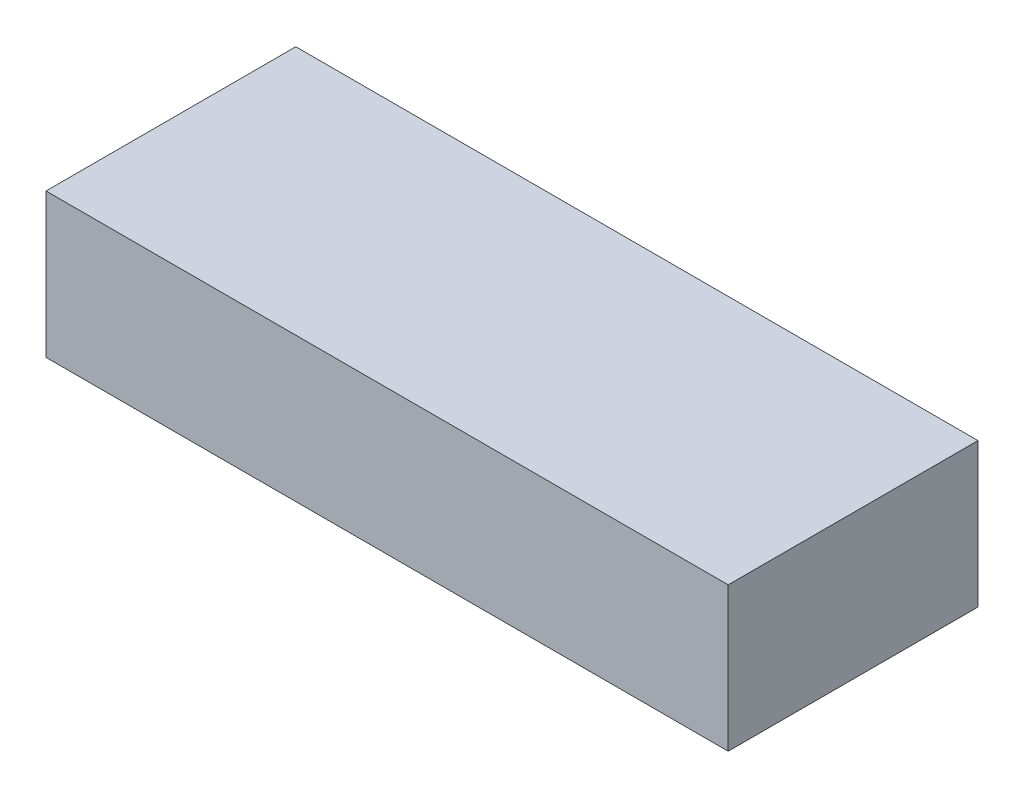
ISO-10303-21;
HEADER;
FILE_DESCRIPTION(('STEP AP214'),'2;1');
FILE_NAME('part.step','',(''),(''),'','','');
FILE_SCHEMA(('AUTOMOTIVE_DESIGN { 1 0 10303 214 1 1 1 1 }'));
ENDSEC;
DATA;
#1=APPLICATION_CONTEXT('core data for automotive mechanical design processes');
#2=APPLICATION_PROTOCOL_DEFINITION('international standard','automotive_design',2000,#1);
#3=PRODUCT_CONTEXT('',#1,'mechanical');
#4=PRODUCT('Part','Part','',(#3));
#5=PRODUCT_RELATED_PRODUCT_CATEGORY('part','',(#4));
#6=PRODUCT_DEFINITION_FORMATION('','',#4);
#7=PRODUCT_DEFINITION_CONTEXT('part definition',#1,'design');
#8=PRODUCT_DEFINITION('design','',#6,#7);
#9=PRODUCT_DEFINITION_SHAPE('','',#8);
#10=(LENGTH_UNIT() NAMED_UNIT(*) SI_UNIT(.MILLI.,.METRE.));
#11=(NAMED_UNIT(*) PLANE_ANGLE_UNIT() SI_UNIT($,.RADIAN.));
#12=(NAMED_UNIT(*) SI_UNIT($,.STERADIAN.) SOLID_ANGLE_UNIT());
#13=UNCERTAINTY_MEASURE_WITH_UNIT(LENGTH_MEASURE(1.E-05),#10,'distance_accuracy_value','');
#14=(GEOMETRIC_REPRESENTATION_CONTEXT(3) GLOBAL_UNCERTAINTY_ASSIGNED_CONTEXT((#13)) GLOBAL_UNIT_ASSIGNED_CONTEXT((#10,
#11,#12)) REPRESENTATION_CONTEXT('',''));
#15=CARTESIAN_POINT('',(0.,0.,0.));
#16=DIRECTION('',(0.,0.,1.));
#17=DIRECTION('',(1.,0.,0.));
#18=AXIS2_PLACEMENT_3D('',#15,#16,#17);
#19=CARTESIAN_POINT('',(-92.7827990114174,-3.76503759398497,52.));
#20=DIRECTION('',(1.,0.,0.));
#21=DIRECTION('',(0.,0.,-1.));
#22=AXIS2_PLACEMENT_3D('',#19,#20,#21);
#23=PLANE('',#22);
#24=DIRECTION('',(0.,-1.,0.));
#25=VECTOR('',#24,1.);
#26=CARTESIAN_POINT('',(-92.7827990114174,-3.76503759398497,0.));
#27=LINE('',#26,#25);
#28=CARTESIAN_POINT('',(-92.7827990114174,-3.76503759398497,0.));
#29=VERTEX_POINT('',#28);
#30=CARTESIAN_POINT('',(-92.7827990114174,-33.765037593985,0.));
#31=VERTEX_POINT('',#30);
#32=EDGE_CURVE('E97',#29,#31,#27,.T.);
#33=ORIENTED_EDGE('',*,*,#32,.T.);
#34=DIRECTION('',(0.,0.,-1.));
#35=VECTOR('',#34,1.);
#36=CARTESIAN_POINT('',(-92.7827990114174,-33.765037593985,52.));
#37=LINE('',#36,#35);
#38=CARTESIAN_POINT('',(-92.7827990114174,-33.765037593985,52.));
#39=VERTEX_POINT('',#38);
#40=EDGE_CURVE('E11',#39,#31,#37,.T.);
#41=ORIENTED_EDGE('',*,*,#40,.F.);
#42=DIRECTION('',(0.,-1.,0.));
#43=VECTOR('',#42,1.);
#44=CARTESIAN_POINT('',(-92.7827990114174,-3.76503759398497,52.));
#45=LINE('',#44,#43);
#46=CARTESIAN_POINT('',(-92.7827990114174,-3.76503759398497,52.));
#47=VERTEX_POINT('',#46);
#48=EDGE_CURVE('E85',#47,#39,#45,.T.);
#49=ORIENTED_EDGE('',*,*,#48,.F.);
#50=DIRECTION('',(0.,0.,-1.));
#51=VECTOR('',#50,1.);
#52=CARTESIAN_POINT('',(-92.7827990114174,-3.76503759398497,52.));
#53=LINE('',#52,#51);
#54=EDGE_CURVE('E93',#47,#29,#53,.T.);
#55=ORIENTED_EDGE('',*,*,#54,.T.);
#56=EDGE_LOOP('',(#33,#41,#49,#55));
#57=FACE_BOUND('',#56,.T.);
#58=ADVANCED_FACE('F34',(#57),#23,.F.);
#59=CARTESIAN_POINT('',(-92.7827990114174,-33.765037593985,52.));
#60=DIRECTION('',(0.,1.,0.));
#61=DIRECTION('',(0.,0.,1.));
#62=AXIS2_PLACEMENT_3D('',#59,#60,#61);
#63=PLANE('',#62);
#64=DIRECTION('',(1.,0.,0.));
#65=VECTOR('',#64,1.);
#66=CARTESIAN_POINT('',(-92.7827990114174,-33.765037593985,0.));
#67=LINE('',#66,#65);
#68=CARTESIAN_POINT('',(49.2172009885826,-33.765037593985,0.));
#69=VERTEX_POINT('',#68);
#70=EDGE_CURVE('E89',#31,#69,#67,.T.);
#71=ORIENTED_EDGE('',*,*,#70,.T.);
#72=DIRECTION('',(0.,0.,-1.));
#73=VECTOR('',#72,1.);
#74=CARTESIAN_POINT('',(49.2172009885826,-33.765037593985,52.));
#75=LINE('',#74,#73);
#76=CARTESIAN_POINT('',(49.2172009885826,-33.765037593985,52.));
#77=VERTEX_POINT('',#76);
#78=EDGE_CURVE('E42',#77,#69,#75,.T.);
#79=ORIENTED_EDGE('',*,*,#78,.F.);
#80=DIRECTION('',(1.,0.,0.));
#81=VECTOR('',#80,1.);
#82=CARTESIAN_POINT('',(-92.7827990114174,-33.765037593985,52.));
#83=LINE('',#82,#81);
#84=EDGE_CURVE('E80',#39,#77,#83,.T.);
#85=ORIENTED_EDGE('',*,*,#84,.F.);
#86=ORIENTED_EDGE('',*,*,#40,.T.);
#87=EDGE_LOOP('',(#71,#79,#85,#86));
#88=FACE_BOUND('',#87,.T.);
#89=ADVANCED_FACE('F88',(#88),#63,.F.);
#90=CARTESIAN_POINT('',(49.2172009885826,-3.76503759398497,52.));
#91=DIRECTION('',(-1.,0.,0.));
#92=DIRECTION('',(0.,-1.,0.));
#93=AXIS2_PLACEMENT_3D('',#90,#91,#92);
#94=PLANE('',#93);
#95=DIRECTION('',(0.,1.,0.));
#96=VECTOR('',#95,1.);
#97=CARTESIAN_POINT('',(49.2172009885826,-3.76503759398497,0.));
#98=LINE('',#97,#96);
#99=CARTESIAN_POINT('',(49.2172009885826,-3.76503759398497,0.));
#100=VERTEX_POINT('',#99);
#101=EDGE_CURVE('E67',#69,#100,#98,.T.);
#102=ORIENTED_EDGE('',*,*,#101,.T.);
#103=DIRECTION('',(0.,0.,-1.));
#104=VECTOR('',#103,1.);
#105=CARTESIAN_POINT('',(49.2172009885826,-3.76503759398497,52.));
#106=LINE('',#105,#104);
#107=CARTESIAN_POINT('',(49.2172009885826,-3.76503759398497,52.));
#108=VERTEX_POINT('',#107);
#109=EDGE_CURVE('E90',#108,#100,#106,.T.);
#110=ORIENTED_EDGE('',*,*,#109,.F.);
#111=DIRECTION('',(0.,1.,0.));
#112=VECTOR('',#111,1.);
#113=CARTESIAN_POINT('',(49.2172009885826,-3.76503759398497,52.));
#114=LINE('',#113,#112);
#115=EDGE_CURVE('E83',#77,#108,#114,.T.);
#116=ORIENTED_EDGE('',*,*,#115,.F.);
#117=ORIENTED_EDGE('',*,*,#78,.T.);
#118=EDGE_LOOP('',(#102,#110,#116,#117));
#119=FACE_BOUND('',#118,.T.);
#120=ADVANCED_FACE('F91',(#119),#94,.F.);
#121=CARTESIAN_POINT('',(-92.7827990114174,-3.76503759398497,52.));
#122=DIRECTION('',(0.,-1.,0.));
#123=DIRECTION('',(0.,0.,-1.));
#124=AXIS2_PLACEMENT_3D('',#121,#122,#123);
#125=PLANE('',#124);
#126=DIRECTION('',(-1.,0.,0.));
#127=VECTOR('',#126,1.);
#128=CARTESIAN_POINT('',(-92.7827990114174,-3.76503759398497,0.));
#129=LINE('',#128,#127);
#130=EDGE_CURVE('E73',#100,#29,#129,.T.);
#131=ORIENTED_EDGE('',*,*,#130,.T.);
#132=ORIENTED_EDGE('',*,*,#54,.F.);
#133=DIRECTION('',(-1.,0.,0.));
#134=VECTOR('',#133,1.);
#135=CARTESIAN_POINT('',(-92.7827990114174,-3.76503759398497,52.));
#136=LINE('',#135,#134);
#137=EDGE_CURVE('E50',#108,#47,#136,.T.);
#138=ORIENTED_EDGE('',*,*,#137,.F.);
#139=ORIENTED_EDGE('',*,*,#109,.T.);
#140=EDGE_LOOP('',(#131,#132,#138,#139));
#141=FACE_BOUND('',#140,.T.);
#142=ADVANCED_FACE('F104',(#141),#125,.F.);
#143=CARTESIAN_POINT('',(0.,0.,52.));
#144=DIRECTION('',(0.,0.,1.));
#145=DIRECTION('',(1.,0.,0.));
#146=AXIS2_PLACEMENT_3D('',#143,#144,#145);
#147=PLANE('',#146);
#148=ORIENTED_EDGE('',*,*,#48,.T.);
#149=ORIENTED_EDGE('',*,*,#84,.T.);
#150=ORIENTED_EDGE('',*,*,#115,.T.);
#151=ORIENTED_EDGE('',*,*,#137,.T.);
#152=EDGE_LOOP('',(#148,#149,#150,#151));
#153=FACE_BOUND('',#152,.T.);
#154=ADVANCED_FACE('F81',(#153),#147,.T.);
#155=CARTESIAN_POINT('',(0.,0.,0.));
#156=DIRECTION('',(0.,0.,1.));
#157=DIRECTION('',(1.,0.,0.));
#158=AXIS2_PLACEMENT_3D('',#155,#156,#157);
#159=PLANE('',#158);
#160=ORIENTED_EDGE('',*,*,#32,.F.);
#161=ORIENTED_EDGE('',*,*,#130,.F.);
#162=ORIENTED_EDGE('',*,*,#101,.F.);
#163=ORIENTED_EDGE('',*,*,#70,.F.);
#164=EDGE_LOOP('',(#160,#161,#162,#163));
#165=FACE_BOUND('',#164,.T.);
#166=ADVANCED_FACE('F107',(#165),#159,.F.);
#167=CLOSED_SHELL('',(#58,#89,#120,#142,#154,#166));
#168=MANIFOLD_SOLID_BREP('B2',#167);
#169=ADVANCED_BREP_SHAPE_REPRESENTATION('',(#18,#168),#14);
#170=SHAPE_DEFINITION_REPRESENTATION(#9,#169);
ENDSEC;
END-ISO-10303-21;
